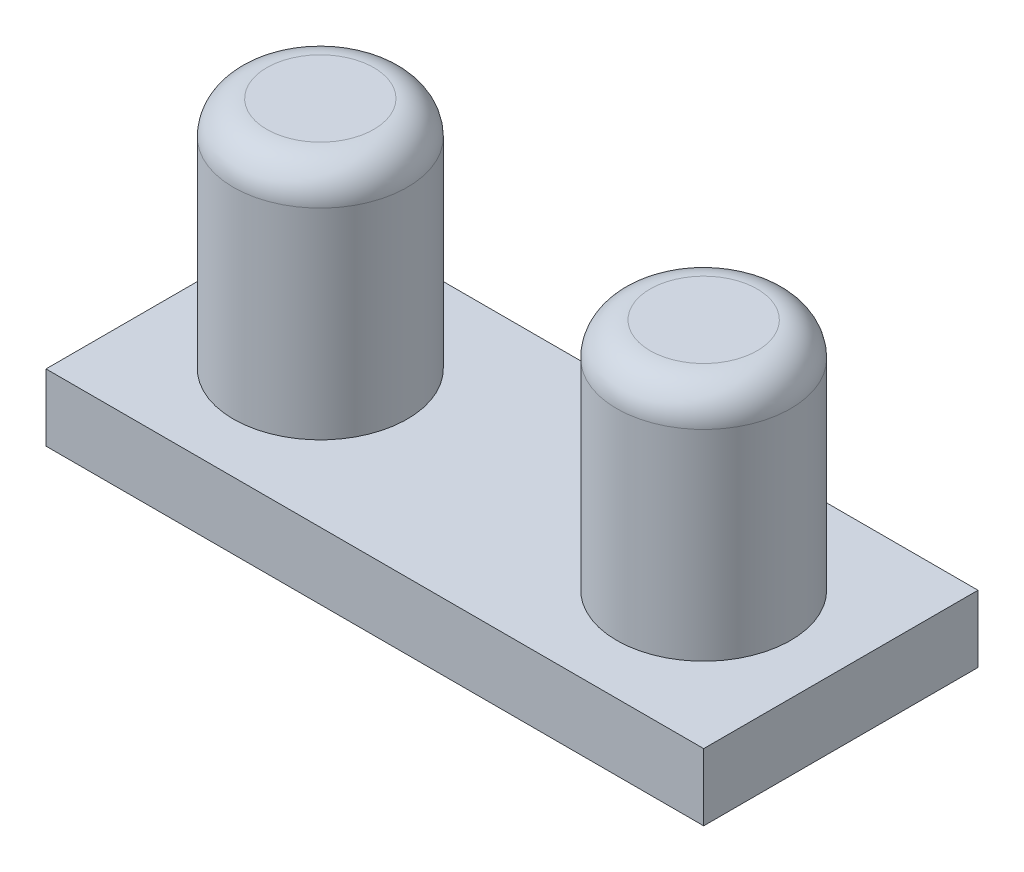
ISO-10303-21;
HEADER;
FILE_DESCRIPTION(('STEP AP214'),'2;1');
FILE_NAME('part.step','',(''),(''),'','','');
FILE_SCHEMA(('AUTOMOTIVE_DESIGN { 1 0 10303 214 1 1 1 1 }'));
ENDSEC;
DATA;
#1=APPLICATION_CONTEXT('core data for automotive mechanical design processes');
#2=APPLICATION_PROTOCOL_DEFINITION('international standard','automotive_design',2000,#1);
#3=PRODUCT_CONTEXT('',#1,'mechanical');
#4=PRODUCT('Part','Part','',(#3));
#5=PRODUCT_RELATED_PRODUCT_CATEGORY('part','',(#4));
#6=PRODUCT_DEFINITION_FORMATION('','',#4);
#7=PRODUCT_DEFINITION_CONTEXT('part definition',#1,'design');
#8=PRODUCT_DEFINITION('design','',#6,#7);
#9=PRODUCT_DEFINITION_SHAPE('','',#8);
#10=(LENGTH_UNIT() NAMED_UNIT(*) SI_UNIT(.MILLI.,.METRE.));
#11=(NAMED_UNIT(*) PLANE_ANGLE_UNIT() SI_UNIT($,.RADIAN.));
#12=(NAMED_UNIT(*) SI_UNIT($,.STERADIAN.) SOLID_ANGLE_UNIT());
#13=UNCERTAINTY_MEASURE_WITH_UNIT(LENGTH_MEASURE(1.E-05),#10,'distance_accuracy_value','');
#14=(GEOMETRIC_REPRESENTATION_CONTEXT(3) GLOBAL_UNCERTAINTY_ASSIGNED_CONTEXT((#13)) GLOBAL_UNIT_ASSIGNED_CONTEXT((#10,
#11,#12)) REPRESENTATION_CONTEXT('',''));
#15=CARTESIAN_POINT('',(0.,0.,0.));
#16=DIRECTION('',(0.,0.,1.));
#17=DIRECTION('',(1.,0.,0.));
#18=AXIS2_PLACEMENT_3D('',#15,#16,#17);
#19=CARTESIAN_POINT('',(9.83,2.,-4.1));
#20=DIRECTION('',(-1.,0.,0.));
#21=DIRECTION('',(0.,0.,1.));
#22=AXIS2_PLACEMENT_3D('',#19,#20,#21);
#23=PLANE('',#22);
#24=DIRECTION('',(0.,0.,-1.));
#25=VECTOR('',#24,1.);
#26=CARTESIAN_POINT('',(9.83,0.,-4.1));
#27=LINE('',#26,#25);
#28=CARTESIAN_POINT('',(9.83,0.,4.1));
#29=VERTEX_POINT('',#28);
#30=CARTESIAN_POINT('',(9.83,0.,-4.1));
#31=VERTEX_POINT('',#30);
#32=EDGE_CURVE('E101',#29,#31,#27,.T.);
#33=ORIENTED_EDGE('',*,*,#32,.T.);
#34=DIRECTION('',(0.,-1.,0.));
#35=VECTOR('',#34,1.);
#36=CARTESIAN_POINT('',(9.83,2.,-4.1));
#37=LINE('',#36,#35);
#38=CARTESIAN_POINT('',(9.83,2.,-4.1));
#39=VERTEX_POINT('',#38);
#40=EDGE_CURVE('E92',#39,#31,#37,.T.);
#41=ORIENTED_EDGE('',*,*,#40,.F.);
#42=DIRECTION('',(0.,0.,-1.));
#43=VECTOR('',#42,1.);
#44=CARTESIAN_POINT('',(9.83,2.,-4.1));
#45=LINE('',#44,#43);
#46=CARTESIAN_POINT('',(9.83,2.,4.1));
#47=VERTEX_POINT('',#46);
#48=EDGE_CURVE('E86',#47,#39,#45,.T.);
#49=ORIENTED_EDGE('',*,*,#48,.F.);
#50=DIRECTION('',(0.,-1.,0.));
#51=VECTOR('',#50,1.);
#52=CARTESIAN_POINT('',(9.83,2.,4.1));
#53=LINE('',#52,#51);
#54=EDGE_CURVE('E97',#47,#29,#53,.T.);
#55=ORIENTED_EDGE('',*,*,#54,.T.);
#56=EDGE_LOOP('',(#33,#41,#49,#55));
#57=FACE_BOUND('',#56,.T.);
#58=ADVANCED_FACE('F33',(#57),#23,.F.);
#59=CARTESIAN_POINT('',(-9.83,2.,-4.1));
#60=DIRECTION('',(0.,0.,1.));
#61=DIRECTION('',(1.,0.,0.));
#62=AXIS2_PLACEMENT_3D('',#59,#60,#61);
#63=PLANE('',#62);
#64=DIRECTION('',(-1.,0.,0.));
#65=VECTOR('',#64,1.);
#66=CARTESIAN_POINT('',(-9.83,0.,-4.1));
#67=LINE('',#66,#65);
#68=CARTESIAN_POINT('',(-9.83,0.,-4.1));
#69=VERTEX_POINT('',#68);
#70=EDGE_CURVE('E91',#31,#69,#67,.T.);
#71=ORIENTED_EDGE('',*,*,#70,.T.);
#72=DIRECTION('',(0.,-1.,0.));
#73=VECTOR('',#72,1.);
#74=CARTESIAN_POINT('',(-9.83,2.,-4.1));
#75=LINE('',#74,#73);
#76=CARTESIAN_POINT('',(-9.83,2.,-4.1));
#77=VERTEX_POINT('',#76);
#78=EDGE_CURVE('E89',#77,#69,#75,.T.);
#79=ORIENTED_EDGE('',*,*,#78,.F.);
#80=DIRECTION('',(-1.,0.,0.));
#81=VECTOR('',#80,1.);
#82=CARTESIAN_POINT('',(-9.83,2.,-4.1));
#83=LINE('',#82,#81);
#84=EDGE_CURVE('E81',#39,#77,#83,.T.);
#85=ORIENTED_EDGE('',*,*,#84,.F.);
#86=ORIENTED_EDGE('',*,*,#40,.T.);
#87=EDGE_LOOP('',(#71,#79,#85,#86));
#88=FACE_BOUND('',#87,.T.);
#89=ADVANCED_FACE('F90',(#88),#63,.F.);
#90=CARTESIAN_POINT('',(-9.83,2.,-4.1));
#91=DIRECTION('',(1.,0.,0.));
#92=DIRECTION('',(0.,0.,-1.));
#93=AXIS2_PLACEMENT_3D('',#90,#91,#92);
#94=PLANE('',#93);
#95=DIRECTION('',(0.,0.,1.));
#96=VECTOR('',#95,1.);
#97=CARTESIAN_POINT('',(-9.83,0.,-4.1));
#98=LINE('',#97,#96);
#99=CARTESIAN_POINT('',(-9.83,0.,4.1));
#100=VERTEX_POINT('',#99);
#101=EDGE_CURVE('E67',#69,#100,#98,.T.);
#102=ORIENTED_EDGE('',*,*,#101,.T.);
#103=DIRECTION('',(0.,-1.,0.));
#104=VECTOR('',#103,1.);
#105=CARTESIAN_POINT('',(-9.83,2.,4.1));
#106=LINE('',#105,#104);
#107=CARTESIAN_POINT('',(-9.83,2.,4.1));
#108=VERTEX_POINT('',#107);
#109=EDGE_CURVE('E93',#108,#100,#106,.T.);
#110=ORIENTED_EDGE('',*,*,#109,.F.);
#111=DIRECTION('',(0.,0.,1.));
#112=VECTOR('',#111,1.);
#113=CARTESIAN_POINT('',(-9.83,2.,-4.1));
#114=LINE('',#113,#112);
#115=EDGE_CURVE('E84',#77,#108,#114,.T.);
#116=ORIENTED_EDGE('',*,*,#115,.F.);
#117=ORIENTED_EDGE('',*,*,#78,.T.);
#118=EDGE_LOOP('',(#102,#110,#116,#117));
#119=FACE_BOUND('',#118,.T.);
#120=ADVANCED_FACE('F95',(#119),#94,.F.);
#121=CARTESIAN_POINT('',(-9.83,2.,4.1));
#122=DIRECTION('',(0.,0.,-1.));
#123=DIRECTION('',(-1.,0.,0.));
#124=AXIS2_PLACEMENT_3D('',#121,#122,#123);
#125=PLANE('',#124);
#126=DIRECTION('',(1.,0.,0.));
#127=VECTOR('',#126,1.);
#128=CARTESIAN_POINT('',(-9.83,0.,4.1));
#129=LINE('',#128,#127);
#130=EDGE_CURVE('E73',#100,#29,#129,.T.);
#131=ORIENTED_EDGE('',*,*,#130,.T.);
#132=ORIENTED_EDGE('',*,*,#54,.F.);
#133=DIRECTION('',(1.,0.,0.));
#134=VECTOR('',#133,1.);
#135=CARTESIAN_POINT('',(-9.83,2.,4.1));
#136=LINE('',#135,#134);
#137=EDGE_CURVE('E50',#108,#47,#136,.T.);
#138=ORIENTED_EDGE('',*,*,#137,.F.);
#139=ORIENTED_EDGE('',*,*,#109,.T.);
#140=EDGE_LOOP('',(#131,#132,#138,#139));
#141=FACE_BOUND('',#140,.T.);
#142=ADVANCED_FACE('F140',(#141),#125,.F.);
#143=CARTESIAN_POINT('',(0.,2.,0.));
#144=DIRECTION('',(0.,1.,0.));
#145=DIRECTION('',(0.,0.,1.));
#146=AXIS2_PLACEMENT_3D('',#143,#144,#145);
#147=PLANE('',#146);
#148=CARTESIAN_POINT('',(5.73,2.,0.));
#149=DIRECTION('',(0.,1.,0.));
#150=DIRECTION('',(0.,0.,1.));
#151=AXIS2_PLACEMENT_3D('',#148,#149,#150);
#152=CIRCLE('',#151,2.6);
#153=CARTESIAN_POINT('',(5.73,2.,2.6));
#154=VERTEX_POINT('',#153);
#155=EDGE_CURVE('E236',#154,#154,#152,.T.);
#156=ORIENTED_EDGE('',*,*,#155,.F.);
#157=EDGE_LOOP('',(#156));
#158=FACE_BOUND('',#157,.T.);
#159=CARTESIAN_POINT('',(-5.73,2.,0.));
#160=DIRECTION('',(0.,1.,0.));
#161=DIRECTION('',(0.,0.,1.));
#162=AXIS2_PLACEMENT_3D('',#159,#160,#161);
#163=CIRCLE('',#162,2.6);
#164=CARTESIAN_POINT('',(-5.73,2.,2.6));
#165=VERTEX_POINT('',#164);
#166=EDGE_CURVE('E104',#165,#165,#163,.T.);
#167=ORIENTED_EDGE('',*,*,#166,.F.);
#168=EDGE_LOOP('',(#167));
#169=FACE_BOUND('',#168,.T.);
#170=ORIENTED_EDGE('',*,*,#48,.T.);
#171=ORIENTED_EDGE('',*,*,#84,.T.);
#172=ORIENTED_EDGE('',*,*,#115,.T.);
#173=ORIENTED_EDGE('',*,*,#137,.T.);
#174=EDGE_LOOP('',(#170,#171,#172,#173));
#175=FACE_BOUND('',#174,.T.);
#176=ADVANCED_FACE('F82',(#158,#169,#175),#147,.T.);
#177=CARTESIAN_POINT('',(0.,0.,0.));
#178=DIRECTION('',(0.,1.,0.));
#179=DIRECTION('',(0.,0.,1.));
#180=AXIS2_PLACEMENT_3D('',#177,#178,#179);
#181=PLANE('',#180);
#182=ORIENTED_EDGE('',*,*,#32,.F.);
#183=ORIENTED_EDGE('',*,*,#130,.F.);
#184=ORIENTED_EDGE('',*,*,#101,.F.);
#185=ORIENTED_EDGE('',*,*,#70,.F.);
#186=EDGE_LOOP('',(#182,#183,#184,#185));
#187=FACE_BOUND('',#186,.T.);
#188=ADVANCED_FACE('F143',(#187),#181,.F.);
#189=CARTESIAN_POINT('',(-5.73,9.,0.));
#190=DIRECTION('',(0.,-1.,0.));
#191=DIRECTION('',(0.,0.,-1.));
#192=AXIS2_PLACEMENT_3D('',#189,#190,#191);
#193=CYLINDRICAL_SURFACE('',#192,2.6);
#194=CARTESIAN_POINT('',(-5.73,8.,0.));
#195=DIRECTION('',(0.,1.,0.));
#196=DIRECTION('',(0.,0.,1.));
#197=AXIS2_PLACEMENT_3D('',#194,#195,#196);
#198=CIRCLE('',#197,2.6);
#199=CARTESIAN_POINT('',(-5.73,8.,2.6));
#200=VERTEX_POINT('',#199);
#201=EDGE_CURVE('E11',#200,#200,#198,.F.);
#202=ORIENTED_EDGE('',*,*,#201,.T.);
#203=EDGE_LOOP('',(#202));
#204=FACE_BOUND('',#203,.T.);
#205=ORIENTED_EDGE('',*,*,#166,.T.);
#206=EDGE_LOOP('',(#205));
#207=FACE_BOUND('',#206,.T.);
#208=ADVANCED_FACE('F146',(#204,#207),#193,.T.);
#209=CARTESIAN_POINT('',(-5.73,9.,0.));
#210=DIRECTION('',(0.,1.,0.));
#211=DIRECTION('',(0.,0.,1.));
#212=AXIS2_PLACEMENT_3D('',#209,#210,#211);
#213=PLANE('',#212);
#214=CARTESIAN_POINT('',(-5.73,9.,0.));
#215=DIRECTION('',(0.,1.,0.));
#216=DIRECTION('',(0.,0.,1.));
#217=AXIS2_PLACEMENT_3D('',#214,#215,#216);
#218=CIRCLE('',#217,1.6);
#219=CARTESIAN_POINT('',(-5.73,9.,1.6));
#220=VERTEX_POINT('',#219);
#221=EDGE_CURVE('E42',#220,#220,#218,.T.);
#222=ORIENTED_EDGE('',*,*,#221,.T.);
#223=EDGE_LOOP('',(#222));
#224=FACE_BOUND('',#223,.T.);
#225=ADVANCED_FACE('F119',(#224),#213,.T.);
#226=CARTESIAN_POINT('',(5.73,9.,0.));
#227=DIRECTION('',(0.,-1.,0.));
#228=DIRECTION('',(0.,0.,-1.));
#229=AXIS2_PLACEMENT_3D('',#226,#227,#228);
#230=CYLINDRICAL_SURFACE('',#229,2.6);
#231=CARTESIAN_POINT('',(5.73,8.,0.));
#232=DIRECTION('',(0.,1.,0.));
#233=DIRECTION('',(0.,0.,1.));
#234=AXIS2_PLACEMENT_3D('',#231,#232,#233);
#235=CIRCLE('',#234,2.6);
#236=CARTESIAN_POINT('',(5.73,8.,2.6));
#237=VERTEX_POINT('',#236);
#238=EDGE_CURVE('E114',#237,#237,#235,.F.);
#239=ORIENTED_EDGE('',*,*,#238,.T.);
#240=EDGE_LOOP('',(#239));
#241=FACE_BOUND('',#240,.T.);
#242=ORIENTED_EDGE('',*,*,#155,.T.);
#243=EDGE_LOOP('',(#242));
#244=FACE_BOUND('',#243,.T.);
#245=ADVANCED_FACE('F156',(#241,#244),#230,.T.);
#246=CARTESIAN_POINT('',(5.73,9.,0.));
#247=DIRECTION('',(0.,1.,0.));
#248=DIRECTION('',(0.,0.,1.));
#249=AXIS2_PLACEMENT_3D('',#246,#247,#248);
#250=PLANE('',#249);
#251=CARTESIAN_POINT('',(5.73,9.,0.));
#252=DIRECTION('',(0.,1.,0.));
#253=DIRECTION('',(0.,0.,1.));
#254=AXIS2_PLACEMENT_3D('',#251,#252,#253);
#255=CIRCLE('',#254,1.6);
#256=CARTESIAN_POINT('',(5.73,9.,1.6));
#257=VERTEX_POINT('',#256);
#258=EDGE_CURVE('E111',#257,#257,#255,.T.);
#259=ORIENTED_EDGE('',*,*,#258,.T.);
#260=EDGE_LOOP('',(#259));
#261=FACE_BOUND('',#260,.T.);
#262=ADVANCED_FACE('F127',(#261),#250,.T.);
#263=CARTESIAN_POINT('',(5.73,8.,0.));
#264=DIRECTION('',(0.,1.,0.));
#265=DIRECTION('',(0.,0.,1.));
#266=AXIS2_PLACEMENT_3D('',#263,#264,#265);
#267=TOROIDAL_SURFACE('',#266,1.6,1.);
#268=ORIENTED_EDGE('',*,*,#238,.F.);
#269=EDGE_LOOP('',(#268));
#270=FACE_BOUND('',#269,.T.);
#271=ORIENTED_EDGE('',*,*,#258,.F.);
#272=EDGE_LOOP('',(#271));
#273=FACE_BOUND('',#272,.T.);
#274=ADVANCED_FACE('F122',(#270,#273),#267,.T.);
#275=CARTESIAN_POINT('',(-5.73,8.,0.));
#276=DIRECTION('',(0.,1.,0.));
#277=DIRECTION('',(0.,0.,1.));
#278=AXIS2_PLACEMENT_3D('',#275,#276,#277);
#279=TOROIDAL_SURFACE('',#278,1.6,1.);
#280=ORIENTED_EDGE('',*,*,#201,.F.);
#281=EDGE_LOOP('',(#280));
#282=FACE_BOUND('',#281,.T.);
#283=ORIENTED_EDGE('',*,*,#221,.F.);
#284=EDGE_LOOP('',(#283));
#285=FACE_BOUND('',#284,.T.);
#286=ADVANCED_FACE('F35',(#282,#285),#279,.T.);
#287=CLOSED_SHELL('',(#58,#89,#120,#142,#176,#188,#208,#225,#245,#262,#274,#286));
#288=MANIFOLD_SOLID_BREP('B2',#287);
#289=ADVANCED_BREP_SHAPE_REPRESENTATION('',(#18,#288),#14);
#290=SHAPE_DEFINITION_REPRESENTATION(#9,#289);
ENDSEC;
END-ISO-10303-21;
